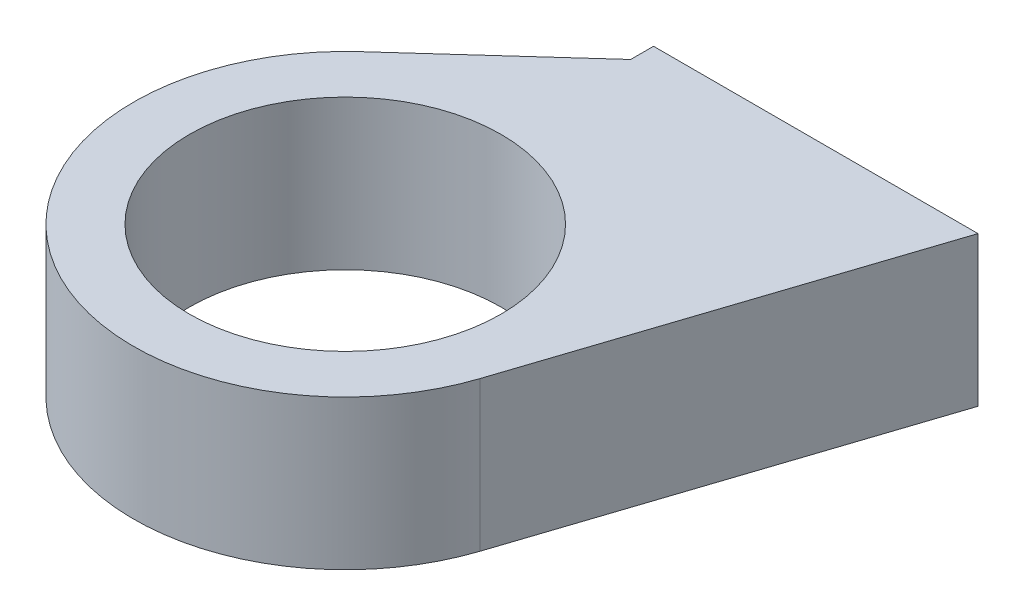
ISO-10303-21;
HEADER;
FILE_DESCRIPTION(('STEP AP214'),'2;1');
FILE_NAME('part.step','',(''),(''),'','','');
FILE_SCHEMA(('AUTOMOTIVE_DESIGN { 1 0 10303 214 1 1 1 1 }'));
ENDSEC;
DATA;
#1=APPLICATION_CONTEXT('core data for automotive mechanical design processes');
#2=APPLICATION_PROTOCOL_DEFINITION('international standard','automotive_design',2000,#1);
#3=PRODUCT_CONTEXT('',#1,'mechanical');
#4=PRODUCT('Part','Part','',(#3));
#5=PRODUCT_RELATED_PRODUCT_CATEGORY('part','',(#4));
#6=PRODUCT_DEFINITION_FORMATION('','',#4);
#7=PRODUCT_DEFINITION_CONTEXT('part definition',#1,'design');
#8=PRODUCT_DEFINITION('design','',#6,#7);
#9=PRODUCT_DEFINITION_SHAPE('','',#8);
#10=(LENGTH_UNIT() NAMED_UNIT(*) SI_UNIT(.MILLI.,.METRE.));
#11=(NAMED_UNIT(*) PLANE_ANGLE_UNIT() SI_UNIT($,.RADIAN.));
#12=(NAMED_UNIT(*) SI_UNIT($,.STERADIAN.) SOLID_ANGLE_UNIT());
#13=UNCERTAINTY_MEASURE_WITH_UNIT(LENGTH_MEASURE(1.E-05),#10,'distance_accuracy_value','');
#14=(GEOMETRIC_REPRESENTATION_CONTEXT(3) GLOBAL_UNCERTAINTY_ASSIGNED_CONTEXT((#13)) GLOBAL_UNIT_ASSIGNED_CONTEXT((#10,
#11,#12)) REPRESENTATION_CONTEXT('',''));
#15=CARTESIAN_POINT('',(0.,0.,0.));
#16=DIRECTION('',(0.,0.,1.));
#17=DIRECTION('',(1.,0.,0.));
#18=AXIS2_PLACEMENT_3D('',#15,#16,#17);
#19=CARTESIAN_POINT('',(23.8125,0.25,40.));
#20=DIRECTION('',(0.,0.,1.));
#21=DIRECTION('',(1.,0.,0.));
#22=AXIS2_PLACEMENT_3D('',#19,#20,#21);
#23=PLANE('',#22);
#24=DIRECTION('',(0.,1.,0.));
#25=VECTOR('',#24,1.);
#26=CARTESIAN_POINT('',(21.975,0.25,40.));
#27=LINE('',#26,#25);
#28=CARTESIAN_POINT('',(21.975,0.25,40.));
#29=VERTEX_POINT('',#28);
#30=CARTESIAN_POINT('',(21.975,11.1125,40.));
#31=VERTEX_POINT('',#30);
#32=EDGE_CURVE('E158',#29,#31,#27,.T.);
#33=ORIENTED_EDGE('',*,*,#32,.F.);
#34=DIRECTION('',(-1.,0.,0.));
#35=VECTOR('',#34,1.);
#36=CARTESIAN_POINT('',(0.25,0.25,40.));
#37=LINE('',#36,#35);
#38=CARTESIAN_POINT('',(-1.5875,0.25,40.));
#39=VERTEX_POINT('',#38);
#40=EDGE_CURVE('E11',#29,#39,#37,.T.);
#41=ORIENTED_EDGE('',*,*,#40,.T.);
#42=DIRECTION('',(0.,1.,0.));
#43=VECTOR('',#42,1.);
#44=CARTESIAN_POINT('',(-1.5875,0.25,40.));
#45=LINE('',#44,#43);
#46=CARTESIAN_POINT('',(-1.5875,11.1125,40.));
#47=VERTEX_POINT('',#46);
#48=EDGE_CURVE('E45',#39,#47,#45,.T.);
#49=ORIENTED_EDGE('',*,*,#48,.T.);
#50=DIRECTION('',(-1.,0.,0.));
#51=VECTOR('',#50,1.);
#52=CARTESIAN_POINT('',(0.460520564077921,11.1125,40.));
#53=LINE('',#52,#51);
#54=EDGE_CURVE('E151',#31,#47,#53,.T.);
#55=ORIENTED_EDGE('',*,*,#54,.F.);
#56=EDGE_LOOP('',(#33,#41,#49,#55));
#57=FACE_BOUND('',#56,.T.);
#58=ADVANCED_FACE('F42',(#57),#23,.F.);
#59=CARTESIAN_POINT('',(-1.5875,0.25,62.3880365220042));
#60=DIRECTION('',(0.,1.,0.));
#61=DIRECTION('',(1.,0.,0.));
#62=AXIS2_PLACEMENT_3D('',#59,#60,#61);
#63=CYLINDRICAL_SURFACE('',#62,11.3125);
#64=CARTESIAN_POINT('',(-1.5875,11.1125,62.3880365220042));
#65=DIRECTION('',(0.,-1.,0.));
#66=DIRECTION('',(1.,0.,0.));
#67=AXIS2_PLACEMENT_3D('',#64,#65,#66);
#68=CIRCLE('',#67,11.3125);
#69=CARTESIAN_POINT('',(-12.9,11.1125,62.3880365220042));
#70=VERTEX_POINT('',#69);
#71=EDGE_CURVE('E120',#70,#70,#68,.T.);
#72=ORIENTED_EDGE('',*,*,#71,.F.);
#73=DIRECTION('',(0.,-1.,0.));
#74=VECTOR('',#73,1.);
#75=CARTESIAN_POINT('',(-12.9,0.25,62.3880365220042));
#76=LINE('',#75,#74);
#77=CARTESIAN_POINT('',(-12.9,0.25,62.3880365220042));
#78=VERTEX_POINT('',#77);
#79=EDGE_CURVE('E67',#70,#78,#76,.T.);
#80=ORIENTED_EDGE('',*,*,#79,.T.);
#81=CARTESIAN_POINT('',(-1.5875,0.25,62.3880365220042));
#82=DIRECTION('',(0.,1.,0.));
#83=DIRECTION('',(1.,0.,0.));
#84=AXIS2_PLACEMENT_3D('',#81,#82,#83);
#85=CIRCLE('',#84,11.3125);
#86=EDGE_CURVE('E108',#78,#78,#85,.T.);
#87=ORIENTED_EDGE('',*,*,#86,.F.);
#88=ORIENTED_EDGE('',*,*,#79,.F.);
#89=EDGE_LOOP('',(#72,#80,#87,#88));
#90=FACE_BOUND('',#89,.T.);
#91=ADVANCED_FACE('F200',(#90),#63,.F.);
#92=CARTESIAN_POINT('',(-1.5875,0.25,36.5));
#93=DIRECTION('',(-1.,0.,0.));
#94=DIRECTION('',(0.,0.,1.));
#95=AXIS2_PLACEMENT_3D('',#92,#93,#94);
#96=PLANE('',#95);
#97=ORIENTED_EDGE('',*,*,#48,.F.);
#98=DIRECTION('',(0.,0.,1.));
#99=VECTOR('',#98,1.);
#100=CARTESIAN_POINT('',(-1.5875,0.25,0.));
#101=LINE('',#100,#99);
#102=CARTESIAN_POINT('',(-1.5875,0.25,41.6621551259154));
#103=VERTEX_POINT('',#102);
#104=EDGE_CURVE('E100',#39,#103,#101,.T.);
#105=ORIENTED_EDGE('',*,*,#104,.T.);
#106=DIRECTION('',(0.,1.,0.));
#107=VECTOR('',#106,1.);
#108=CARTESIAN_POINT('',(-1.5875,0.25,41.6621551259154));
#109=LINE('',#108,#107);
#110=CARTESIAN_POINT('',(-1.5875,11.1125,41.6621551259154));
#111=VERTEX_POINT('',#110);
#112=EDGE_CURVE('E103',#103,#111,#109,.T.);
#113=ORIENTED_EDGE('',*,*,#112,.T.);
#114=DIRECTION('',(0.,0.,1.));
#115=VECTOR('',#114,1.);
#116=CARTESIAN_POINT('',(-1.5875,11.1125,0.));
#117=LINE('',#116,#115);
#118=EDGE_CURVE('E136',#47,#111,#117,.T.);
#119=ORIENTED_EDGE('',*,*,#118,.F.);
#120=EDGE_LOOP('',(#97,#105,#113,#119));
#121=FACE_BOUND('',#120,.T.);
#122=ADVANCED_FACE('F102',(#121),#96,.T.);
#123=CARTESIAN_POINT('',(-1.5875,0.25,41.6621551259154));
#124=DIRECTION('',(-0.670836783631383,0.,-0.741605022722406));
#125=DIRECTION('',(-0.741605022722406,0.,0.670836783631383));
#126=AXIS2_PLACEMENT_3D('',#123,#124,#125);
#127=PLANE('',#126);
#128=DIRECTION('',(-0.741605022722406,0.,0.670836783631383));
#129=VECTOR('',#128,1.);
#130=CARTESIAN_POINT('',(0.25,0.25,40.));
#131=LINE('',#130,#129);
#132=CARTESIAN_POINT('',(-11.8985416022466,0.25,50.9892575219433));
#133=VERTEX_POINT('',#132);
#134=EDGE_CURVE('E109',#103,#133,#131,.T.);
#135=ORIENTED_EDGE('',*,*,#134,.T.);
#136=DIRECTION('',(0.,1.,0.));
#137=VECTOR('',#136,1.);
#138=CARTESIAN_POINT('',(-11.8985416022466,0.25,50.9892575219433));
#139=LINE('',#138,#137);
#140=CARTESIAN_POINT('',(-11.8985416022466,11.1125,50.9892575219433));
#141=VERTEX_POINT('',#140);
#142=EDGE_CURVE('E139',#133,#141,#139,.T.);
#143=ORIENTED_EDGE('',*,*,#142,.T.);
#144=DIRECTION('',(-0.741605022722406,0.,0.670836783631383));
#145=VECTOR('',#144,1.);
#146=CARTESIAN_POINT('',(0.25,11.1125,40.));
#147=LINE('',#146,#145);
#148=EDGE_CURVE('E117',#111,#141,#147,.T.);
#149=ORIENTED_EDGE('',*,*,#148,.F.);
#150=ORIENTED_EDGE('',*,*,#112,.F.);
#151=EDGE_LOOP('',(#135,#143,#149,#150));
#152=FACE_BOUND('',#151,.T.);
#153=ADVANCED_FACE('F113',(#152),#127,.T.);
#154=CARTESIAN_POINT('',(-1.5875,0.25,62.3880365220042));
#155=DIRECTION('',(0.,1.,0.));
#156=DIRECTION('',(-0.545442437282533,0.,0.838148284977837));
#157=AXIS2_PLACEMENT_3D('',#154,#155,#156);
#158=CYLINDRICAL_SURFACE('',#157,15.3704177436883);
#159=CARTESIAN_POINT('',(-1.5875,0.25,62.3880365220042));
#160=DIRECTION('',(0.,-1.,0.));
#161=DIRECTION('',(1.,0.,0.));
#162=AXIS2_PLACEMENT_3D('',#159,#160,#161);
#163=CIRCLE('',#162,15.3704177436883);
#164=CARTESIAN_POINT('',(13.0104872451171,0.25,67.1993263705675));
#165=VERTEX_POINT('',#164);
#166=EDGE_CURVE('E126',#165,#133,#163,.T.);
#167=ORIENTED_EDGE('',*,*,#166,.F.);
#168=DIRECTION('',(0.,1.,0.));
#169=VECTOR('',#168,1.);
#170=CARTESIAN_POINT('',(13.0104872451171,0.25,67.1993263705675));
#171=LINE('',#170,#169);
#172=CARTESIAN_POINT('',(13.0104872451171,11.1125,67.1993263705675));
#173=VERTEX_POINT('',#172);
#174=EDGE_CURVE('E141',#165,#173,#171,.T.);
#175=ORIENTED_EDGE('',*,*,#174,.T.);
#176=CARTESIAN_POINT('',(-1.5875,11.1125,62.3880365220042));
#177=DIRECTION('',(0.,1.,0.));
#178=DIRECTION('',(1.,0.,0.));
#179=AXIS2_PLACEMENT_3D('',#176,#177,#178);
#180=CIRCLE('',#179,15.3704177436883);
#181=EDGE_CURVE('E144',#141,#173,#180,.T.);
#182=ORIENTED_EDGE('',*,*,#181,.F.);
#183=ORIENTED_EDGE('',*,*,#142,.F.);
#184=EDGE_LOOP('',(#167,#175,#182,#183));
#185=FACE_BOUND('',#184,.T.);
#186=ADVANCED_FACE('F173',(#185),#158,.T.);
#187=CARTESIAN_POINT('',(13.0104872451171,0.25,67.1993263705675));
#188=DIRECTION('',(0.949745640525064,0.,0.313022712121079));
#189=DIRECTION('',(0.,-1.,0.));
#190=AXIS2_PLACEMENT_3D('',#187,#188,#189);
#191=PLANE('',#190);
#192=DIRECTION('',(-0.313022712121079,0.,0.949745640525064));
#193=VECTOR('',#192,1.);
#194=CARTESIAN_POINT('',(21.975,0.25,40.));
#195=LINE('',#194,#193);
#196=EDGE_CURVE('E133',#29,#165,#195,.T.);
#197=ORIENTED_EDGE('',*,*,#196,.F.);
#198=ORIENTED_EDGE('',*,*,#32,.T.);
#199=DIRECTION('',(0.313022712121079,0.,-0.949745640525064));
#200=VECTOR('',#199,1.);
#201=CARTESIAN_POINT('',(21.975,11.1125,40.));
#202=LINE('',#201,#200);
#203=EDGE_CURVE('E145',#173,#31,#202,.T.);
#204=ORIENTED_EDGE('',*,*,#203,.F.);
#205=ORIENTED_EDGE('',*,*,#174,.F.);
#206=EDGE_LOOP('',(#197,#198,#204,#205));
#207=FACE_BOUND('',#206,.T.);
#208=ADVANCED_FACE('F176',(#207),#191,.T.);
#209=CARTESIAN_POINT('',(0.25,0.25,0.));
#210=DIRECTION('',(0.,-1.,0.));
#211=DIRECTION('',(0.,0.,-1.));
#212=AXIS2_PLACEMENT_3D('',#209,#210,#211);
#213=PLANE('',#212);
#214=ORIENTED_EDGE('',*,*,#40,.F.);
#215=ORIENTED_EDGE('',*,*,#196,.T.);
#216=ORIENTED_EDGE('',*,*,#166,.T.);
#217=ORIENTED_EDGE('',*,*,#134,.F.);
#218=ORIENTED_EDGE('',*,*,#104,.F.);
#219=EDGE_LOOP('',(#214,#215,#216,#217,#218));
#220=FACE_BOUND('',#219,.T.);
#221=ORIENTED_EDGE('',*,*,#86,.T.);
#222=EDGE_LOOP('',(#221));
#223=FACE_BOUND('',#222,.T.);
#224=ADVANCED_FACE('F122',(#220,#223),#213,.T.);
#225=CARTESIAN_POINT('',(2.50854112815585,11.1125,57.1292271328463));
#226=DIRECTION('',(0.,-1.,0.));
#227=DIRECTION('',(0.,0.,-1.));
#228=AXIS2_PLACEMENT_3D('',#225,#226,#227);
#229=PLANE('',#228);
#230=ORIENTED_EDGE('',*,*,#71,.T.);
#231=EDGE_LOOP('',(#230));
#232=FACE_BOUND('',#231,.T.);
#233=ORIENTED_EDGE('',*,*,#54,.T.);
#234=ORIENTED_EDGE('',*,*,#118,.T.);
#235=ORIENTED_EDGE('',*,*,#148,.T.);
#236=ORIENTED_EDGE('',*,*,#181,.T.);
#237=ORIENTED_EDGE('',*,*,#203,.T.);
#238=EDGE_LOOP('',(#233,#234,#235,#236,#237));
#239=FACE_BOUND('',#238,.T.);
#240=ADVANCED_FACE('F179',(#232,#239),#229,.F.);
#241=CLOSED_SHELL('',(#58,#91,#122,#153,#186,#208,#224,#240));
#242=MANIFOLD_SOLID_BREP('B2',#241);
#243=ADVANCED_BREP_SHAPE_REPRESENTATION('',(#18,#242),#14);
#244=SHAPE_DEFINITION_REPRESENTATION(#9,#243);
ENDSEC;
END-ISO-10303-21;
